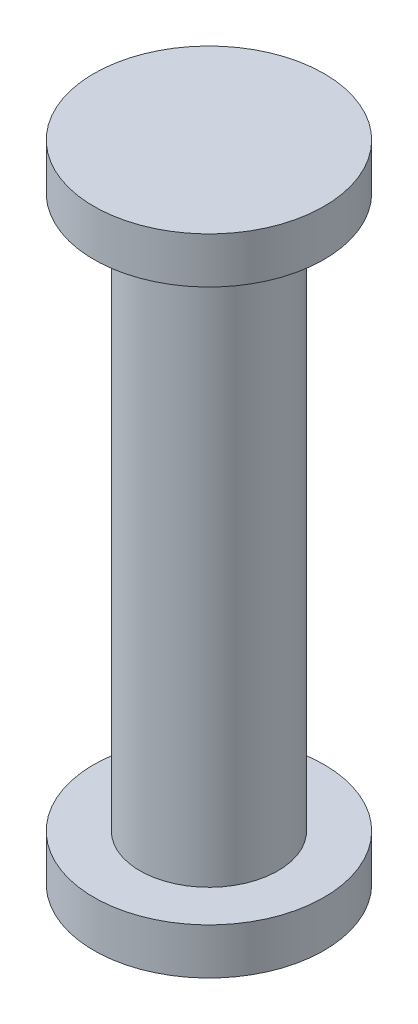
ISO-10303-21;
HEADER;
FILE_DESCRIPTION(('STEP AP214'),'2;1');
FILE_NAME('part.step','',(''),(''),'','','');
FILE_SCHEMA(('AUTOMOTIVE_DESIGN { 1 0 10303 214 1 1 1 1 }'));
ENDSEC;
DATA;
#1=APPLICATION_CONTEXT('core data for automotive mechanical design processes');
#2=APPLICATION_PROTOCOL_DEFINITION('international standard','automotive_design',2000,#1);
#3=PRODUCT_CONTEXT('',#1,'mechanical');
#4=PRODUCT('Part','Part','',(#3));
#5=PRODUCT_RELATED_PRODUCT_CATEGORY('part','',(#4));
#6=PRODUCT_DEFINITION_FORMATION('','',#4);
#7=PRODUCT_DEFINITION_CONTEXT('part definition',#1,'design');
#8=PRODUCT_DEFINITION('design','',#6,#7);
#9=PRODUCT_DEFINITION_SHAPE('','',#8);
#10=(LENGTH_UNIT() NAMED_UNIT(*) SI_UNIT(.MILLI.,.METRE.));
#11=(NAMED_UNIT(*) PLANE_ANGLE_UNIT() SI_UNIT($,.RADIAN.));
#12=(NAMED_UNIT(*) SI_UNIT($,.STERADIAN.) SOLID_ANGLE_UNIT());
#13=UNCERTAINTY_MEASURE_WITH_UNIT(LENGTH_MEASURE(1.E-05),#10,'distance_accuracy_value','');
#14=(GEOMETRIC_REPRESENTATION_CONTEXT(3) GLOBAL_UNCERTAINTY_ASSIGNED_CONTEXT((#13)) GLOBAL_UNIT_ASSIGNED_CONTEXT((#10,
#11,#12)) REPRESENTATION_CONTEXT('',''));
#15=CARTESIAN_POINT('',(0.,0.,0.));
#16=DIRECTION('',(0.,0.,1.));
#17=DIRECTION('',(1.,0.,0.));
#18=AXIS2_PLACEMENT_3D('',#15,#16,#17);
#19=CARTESIAN_POINT('',(-2.5,0.,0.));
#20=DIRECTION('',(0.,1.,0.));
#21=DIRECTION('',(0.,0.,1.));
#22=AXIS2_PLACEMENT_3D('',#19,#20,#21);
#23=PLANE('',#22);
#24=CARTESIAN_POINT('',(0.,0.,0.));
#25=DIRECTION('',(0.,-1.,0.));
#26=DIRECTION('',(0.,0.,-1.));
#27=AXIS2_PLACEMENT_3D('',#24,#25,#26);
#28=CIRCLE('',#27,2.5);
#29=CARTESIAN_POINT('',(0.,0.,-2.5));
#30=VERTEX_POINT('',#29);
#31=EDGE_CURVE('E53',#30,#30,#28,.T.);
#32=ORIENTED_EDGE('',*,*,#31,.T.);
#33=EDGE_LOOP('',(#32));
#34=FACE_BOUND('',#33,.T.);
#35=ADVANCED_FACE('F31',(#34),#23,.F.);
#36=CARTESIAN_POINT('',(0.,14.,0.));
#37=DIRECTION('',(0.,-1.,0.));
#38=DIRECTION('',(0.,0.,-1.));
#39=AXIS2_PLACEMENT_3D('',#36,#37,#38);
#40=PLANE('',#39);
#41=CARTESIAN_POINT('',(0.,14.,0.));
#42=DIRECTION('',(0.,-1.,0.));
#43=DIRECTION('',(0.,0.,-1.));
#44=AXIS2_PLACEMENT_3D('',#41,#42,#43);
#45=CIRCLE('',#44,2.5);
#46=CARTESIAN_POINT('',(0.,14.,-2.5));
#47=VERTEX_POINT('',#46);
#48=EDGE_CURVE('E10',#47,#47,#45,.T.);
#49=ORIENTED_EDGE('',*,*,#48,.F.);
#50=EDGE_LOOP('',(#49));
#51=FACE_BOUND('',#50,.T.);
#52=ADVANCED_FACE('F83',(#51),#40,.F.);
#53=CARTESIAN_POINT('',(0.,0.,0.));
#54=DIRECTION('',(0.,-1.,0.));
#55=DIRECTION('',(0.,0.,-1.));
#56=AXIS2_PLACEMENT_3D('',#53,#54,#55);
#57=CYLINDRICAL_SURFACE('',#56,2.5);
#58=CARTESIAN_POINT('',(0.,13.,0.));
#59=DIRECTION('',(0.,-1.,0.));
#60=DIRECTION('',(0.,0.,-1.));
#61=AXIS2_PLACEMENT_3D('',#58,#59,#60);
#62=CIRCLE('',#61,2.5);
#63=CARTESIAN_POINT('',(0.,13.,-2.5));
#64=VERTEX_POINT('',#63);
#65=EDGE_CURVE('E37',#64,#64,#62,.T.);
#66=ORIENTED_EDGE('',*,*,#65,.F.);
#67=EDGE_LOOP('',(#66));
#68=FACE_BOUND('',#67,.T.);
#69=ORIENTED_EDGE('',*,*,#48,.T.);
#70=EDGE_LOOP('',(#69));
#71=FACE_BOUND('',#70,.T.);
#72=ADVANCED_FACE('F78',(#68,#71),#57,.T.);
#73=CARTESIAN_POINT('',(-2.5,13.,0.));
#74=DIRECTION('',(0.,1.,0.));
#75=DIRECTION('',(0.,0.,1.));
#76=AXIS2_PLACEMENT_3D('',#73,#74,#75);
#77=PLANE('',#76);
#78=CARTESIAN_POINT('',(0.,13.,0.));
#79=DIRECTION('',(0.,-1.,0.));
#80=DIRECTION('',(0.,0.,-1.));
#81=AXIS2_PLACEMENT_3D('',#78,#79,#80);
#82=CIRCLE('',#81,1.5);
#83=CARTESIAN_POINT('',(0.,13.,-1.5));
#84=VERTEX_POINT('',#83);
#85=EDGE_CURVE('E41',#84,#84,#82,.T.);
#86=ORIENTED_EDGE('',*,*,#85,.F.);
#87=EDGE_LOOP('',(#86));
#88=FACE_BOUND('',#87,.T.);
#89=ORIENTED_EDGE('',*,*,#65,.T.);
#90=EDGE_LOOP('',(#89));
#91=FACE_BOUND('',#90,.T.);
#92=ADVANCED_FACE('F73',(#88,#91),#77,.F.);
#93=CARTESIAN_POINT('',(0.,0.,0.));
#94=DIRECTION('',(0.,-1.,0.));
#95=DIRECTION('',(0.,0.,-1.));
#96=AXIS2_PLACEMENT_3D('',#93,#94,#95);
#97=CYLINDRICAL_SURFACE('',#96,1.5);
#98=CARTESIAN_POINT('',(0.,1.,0.));
#99=DIRECTION('',(0.,-1.,0.));
#100=DIRECTION('',(0.,0.,-1.));
#101=AXIS2_PLACEMENT_3D('',#98,#99,#100);
#102=CIRCLE('',#101,1.5);
#103=CARTESIAN_POINT('',(0.,1.,-1.5));
#104=VERTEX_POINT('',#103);
#105=EDGE_CURVE('E45',#104,#104,#102,.T.);
#106=ORIENTED_EDGE('',*,*,#105,.F.);
#107=EDGE_LOOP('',(#106));
#108=FACE_BOUND('',#107,.T.);
#109=ORIENTED_EDGE('',*,*,#85,.T.);
#110=EDGE_LOOP('',(#109));
#111=FACE_BOUND('',#110,.T.);
#112=ADVANCED_FACE('F67',(#108,#111),#97,.T.);
#113=CARTESIAN_POINT('',(-1.5,1.,0.));
#114=DIRECTION('',(0.,-1.,0.));
#115=DIRECTION('',(0.,0.,-1.));
#116=AXIS2_PLACEMENT_3D('',#113,#114,#115);
#117=PLANE('',#116);
#118=CARTESIAN_POINT('',(0.,1.,0.));
#119=DIRECTION('',(0.,-1.,0.));
#120=DIRECTION('',(0.,0.,-1.));
#121=AXIS2_PLACEMENT_3D('',#118,#119,#120);
#122=CIRCLE('',#121,2.5);
#123=CARTESIAN_POINT('',(0.,1.,-2.5));
#124=VERTEX_POINT('',#123);
#125=EDGE_CURVE('E50',#124,#124,#122,.T.);
#126=ORIENTED_EDGE('',*,*,#125,.F.);
#127=EDGE_LOOP('',(#126));
#128=FACE_BOUND('',#127,.T.);
#129=ORIENTED_EDGE('',*,*,#105,.T.);
#130=EDGE_LOOP('',(#129));
#131=FACE_BOUND('',#130,.T.);
#132=ADVANCED_FACE('F61',(#128,#131),#117,.F.);
#133=CARTESIAN_POINT('',(0.,0.,0.));
#134=DIRECTION('',(0.,-1.,0.));
#135=DIRECTION('',(0.,0.,-1.));
#136=AXIS2_PLACEMENT_3D('',#133,#134,#135);
#137=CYLINDRICAL_SURFACE('',#136,2.5);
#138=ORIENTED_EDGE('',*,*,#31,.F.);
#139=EDGE_LOOP('',(#138));
#140=FACE_BOUND('',#139,.T.);
#141=ORIENTED_EDGE('',*,*,#125,.T.);
#142=EDGE_LOOP('',(#141));
#143=FACE_BOUND('',#142,.T.);
#144=ADVANCED_FACE('F58',(#140,#143),#137,.T.);
#145=CLOSED_SHELL('',(#35,#52,#72,#92,#112,#132,#144));
#146=MANIFOLD_SOLID_BREP('B2',#145);
#147=ADVANCED_BREP_SHAPE_REPRESENTATION('',(#18,#146),#14);
#148=SHAPE_DEFINITION_REPRESENTATION(#9,#147);
ENDSEC;
END-ISO-10303-21;
